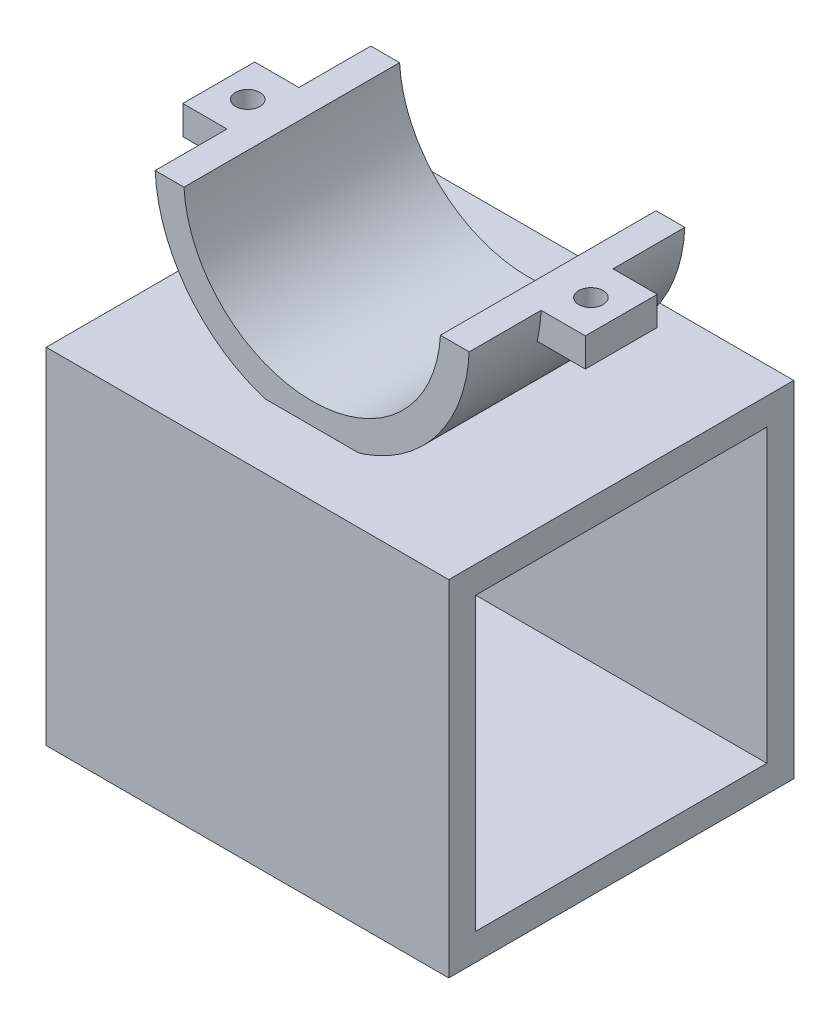
ISO-10303-21;
HEADER;
FILE_DESCRIPTION(('STEP AP214'),'2;1');
FILE_NAME('part.step','',(''),(''),'','','');
FILE_SCHEMA(('AUTOMOTIVE_DESIGN { 1 0 10303 214 1 1 1 1 }'));
ENDSEC;
DATA;
#1=APPLICATION_CONTEXT('core data for automotive mechanical design processes');
#2=APPLICATION_PROTOCOL_DEFINITION('international standard','automotive_design',2000,#1);
#3=PRODUCT_CONTEXT('',#1,'mechanical');
#4=PRODUCT('Part','Part','',(#3));
#5=PRODUCT_RELATED_PRODUCT_CATEGORY('part','',(#4));
#6=PRODUCT_DEFINITION_FORMATION('','',#4);
#7=PRODUCT_DEFINITION_CONTEXT('part definition',#1,'design');
#8=PRODUCT_DEFINITION('design','',#6,#7);
#9=PRODUCT_DEFINITION_SHAPE('','',#8);
#10=(LENGTH_UNIT() NAMED_UNIT(*) SI_UNIT(.MILLI.,.METRE.));
#11=(NAMED_UNIT(*) PLANE_ANGLE_UNIT() SI_UNIT($,.RADIAN.));
#12=(NAMED_UNIT(*) SI_UNIT($,.STERADIAN.) SOLID_ANGLE_UNIT());
#13=UNCERTAINTY_MEASURE_WITH_UNIT(LENGTH_MEASURE(1.E-05),#10,'distance_accuracy_value','');
#14=(GEOMETRIC_REPRESENTATION_CONTEXT(3) GLOBAL_UNCERTAINTY_ASSIGNED_CONTEXT((#13)) GLOBAL_UNIT_ASSIGNED_CONTEXT((#10,
#11,#12)) REPRESENTATION_CONTEXT('',''));
#15=CARTESIAN_POINT('',(0.,0.,0.));
#16=DIRECTION('',(0.,0.,1.));
#17=DIRECTION('',(1.,0.,0.));
#18=AXIS2_PLACEMENT_3D('',#15,#16,#17);
#19=CARTESIAN_POINT('',(-28.,-20.87,-24.));
#20=DIRECTION('',(0.,0.,-1.));
#21=DIRECTION('',(0.,1.,0.));
#22=AXIS2_PLACEMENT_3D('',#19,#20,#21);
#23=PLANE('',#22);
#24=DIRECTION('',(1.,0.,0.));
#25=VECTOR('',#24,1.);
#26=CARTESIAN_POINT('',(-28.,-20.87,-24.));
#27=LINE('',#26,#25);
#28=CARTESIAN_POINT('',(-28.,-20.87,-24.));
#29=VERTEX_POINT('',#28);
#30=CARTESIAN_POINT('',(28.,-20.87,-24.));
#31=VERTEX_POINT('',#30);
#32=EDGE_CURVE('E52',#29,#31,#27,.T.);
#33=ORIENTED_EDGE('',*,*,#32,.T.);
#34=DIRECTION('',(0.,1.,0.));
#35=VECTOR('',#34,1.);
#36=CARTESIAN_POINT('',(28.,-20.87,-24.));
#37=LINE('',#36,#35);
#38=CARTESIAN_POINT('',(28.,-68.87,-24.));
#39=VERTEX_POINT('',#38);
#40=EDGE_CURVE('E152',#39,#31,#37,.T.);
#41=ORIENTED_EDGE('',*,*,#40,.F.);
#42=DIRECTION('',(1.,0.,0.));
#43=VECTOR('',#42,1.);
#44=CARTESIAN_POINT('',(-28.,-68.87,-24.));
#45=LINE('',#44,#43);
#46=CARTESIAN_POINT('',(-28.,-68.87,-24.));
#47=VERTEX_POINT('',#46);
#48=EDGE_CURVE('E12',#47,#39,#45,.T.);
#49=ORIENTED_EDGE('',*,*,#48,.F.);
#50=DIRECTION('',(0.,1.,0.));
#51=VECTOR('',#50,1.);
#52=CARTESIAN_POINT('',(-28.,-20.87,-24.));
#53=LINE('',#52,#51);
#54=EDGE_CURVE('E180',#47,#29,#53,.T.);
#55=ORIENTED_EDGE('',*,*,#54,.T.);
#56=EDGE_LOOP('',(#33,#41,#49,#55));
#57=FACE_BOUND('',#56,.T.);
#58=ADVANCED_FACE('F49',(#57),#23,.T.);
#59=CARTESIAN_POINT('',(-28.,-68.87,24.));
#60=DIRECTION('',(0.,-1.,0.));
#61=DIRECTION('',(0.,0.,-1.));
#62=AXIS2_PLACEMENT_3D('',#59,#60,#61);
#63=PLANE('',#62);
#64=CARTESIAN_POINT('',(0.,-68.87,0.));
#65=DIRECTION('',(0.,-1.,0.));
#66=DIRECTION('',(0.,0.,-1.));
#67=AXIS2_PLACEMENT_3D('',#64,#65,#66);
#68=CIRCLE('',#67,4.5);
#69=CARTESIAN_POINT('',(0.,-68.87,-4.5));
#70=VERTEX_POINT('',#69);
#71=EDGE_CURVE('E138',#70,#70,#68,.T.);
#72=ORIENTED_EDGE('',*,*,#71,.F.);
#73=EDGE_LOOP('',(#72));
#74=FACE_BOUND('',#73,.T.);
#75=ORIENTED_EDGE('',*,*,#48,.T.);
#76=DIRECTION('',(0.,0.,-1.));
#77=VECTOR('',#76,1.);
#78=CARTESIAN_POINT('',(28.,-68.87,24.));
#79=LINE('',#78,#77);
#80=CARTESIAN_POINT('',(28.,-68.87,24.));
#81=VERTEX_POINT('',#80);
#82=EDGE_CURVE('E164',#81,#39,#79,.T.);
#83=ORIENTED_EDGE('',*,*,#82,.F.);
#84=DIRECTION('',(1.,0.,0.));
#85=VECTOR('',#84,1.);
#86=CARTESIAN_POINT('',(-28.,-68.87,24.));
#87=LINE('',#86,#85);
#88=CARTESIAN_POINT('',(-28.,-68.87,24.));
#89=VERTEX_POINT('',#88);
#90=EDGE_CURVE('E58',#89,#81,#87,.T.);
#91=ORIENTED_EDGE('',*,*,#90,.F.);
#92=DIRECTION('',(0.,0.,-1.));
#93=VECTOR('',#92,1.);
#94=CARTESIAN_POINT('',(-28.,-68.87,24.));
#95=LINE('',#94,#93);
#96=EDGE_CURVE('E196',#89,#47,#95,.T.);
#97=ORIENTED_EDGE('',*,*,#96,.T.);
#98=EDGE_LOOP('',(#75,#83,#91,#97));
#99=FACE_BOUND('',#98,.T.);
#100=ADVANCED_FACE('F212',(#74,#99),#63,.T.);
#101=CARTESIAN_POINT('',(-28.,-20.87,24.));
#102=DIRECTION('',(0.,0.,1.));
#103=DIRECTION('',(1.,0.,0.));
#104=AXIS2_PLACEMENT_3D('',#101,#102,#103);
#105=PLANE('',#104);
#106=ORIENTED_EDGE('',*,*,#90,.T.);
#107=DIRECTION('',(0.,-1.,0.));
#108=VECTOR('',#107,1.);
#109=CARTESIAN_POINT('',(28.,-20.87,24.));
#110=LINE('',#109,#108);
#111=CARTESIAN_POINT('',(28.,-20.87,24.));
#112=VERTEX_POINT('',#111);
#113=EDGE_CURVE('E160',#112,#81,#110,.T.);
#114=ORIENTED_EDGE('',*,*,#113,.F.);
#115=DIRECTION('',(1.,0.,0.));
#116=VECTOR('',#115,1.);
#117=CARTESIAN_POINT('',(-28.,-20.87,24.));
#118=LINE('',#117,#116);
#119=CARTESIAN_POINT('',(-28.,-20.87,24.));
#120=VERTEX_POINT('',#119);
#121=EDGE_CURVE('E201',#120,#112,#118,.T.);
#122=ORIENTED_EDGE('',*,*,#121,.F.);
#123=DIRECTION('',(0.,-1.,0.));
#124=VECTOR('',#123,1.);
#125=CARTESIAN_POINT('',(-28.,-20.87,24.));
#126=LINE('',#125,#124);
#127=EDGE_CURVE('E192',#120,#89,#126,.T.);
#128=ORIENTED_EDGE('',*,*,#127,.T.);
#129=EDGE_LOOP('',(#106,#114,#122,#128));
#130=FACE_BOUND('',#129,.T.);
#131=ADVANCED_FACE('F218',(#130),#105,.T.);
#132=CARTESIAN_POINT('',(-28.,-20.87,24.));
#133=DIRECTION('',(0.,1.,0.));
#134=DIRECTION('',(0.,0.,1.));
#135=AXIS2_PLACEMENT_3D('',#132,#133,#134);
#136=PLANE('',#135);
#137=ORIENTED_EDGE('',*,*,#121,.T.);
#138=DIRECTION('',(0.,0.,1.));
#139=VECTOR('',#138,1.);
#140=CARTESIAN_POINT('',(28.,-20.87,24.));
#141=LINE('',#140,#139);
#142=EDGE_CURVE('E156',#31,#112,#141,.T.);
#143=ORIENTED_EDGE('',*,*,#142,.F.);
#144=ORIENTED_EDGE('',*,*,#32,.F.);
#145=DIRECTION('',(0.,0.,1.));
#146=VECTOR('',#145,1.);
#147=CARTESIAN_POINT('',(-28.,-20.87,24.));
#148=LINE('',#147,#146);
#149=EDGE_CURVE('E188',#29,#120,#148,.T.);
#150=ORIENTED_EDGE('',*,*,#149,.T.);
#151=EDGE_LOOP('',(#137,#143,#144,#150));
#152=FACE_BOUND('',#151,.T.);
#153=ADVANCED_FACE('F207',(#152),#136,.T.);
#154=CARTESIAN_POINT('',(-28.,0.,0.));
#155=DIRECTION('',(1.,0.,0.));
#156=DIRECTION('',(0.,0.,-1.));
#157=AXIS2_PLACEMENT_3D('',#154,#155,#156);
#158=PLANE('',#157);
#159=DIRECTION('',(0.,0.,-1.));
#160=VECTOR('',#159,1.);
#161=CARTESIAN_POINT('',(-28.,-65.12,20.25));
#162=LINE('',#161,#160);
#163=CARTESIAN_POINT('',(-28.,-65.12,20.25));
#164=VERTEX_POINT('',#163);
#165=CARTESIAN_POINT('',(-28.,-65.12,-20.25));
#166=VERTEX_POINT('',#165);
#167=EDGE_CURVE('E128',#164,#166,#162,.T.);
#168=ORIENTED_EDGE('',*,*,#167,.T.);
#169=DIRECTION('',(0.,1.,0.));
#170=VECTOR('',#169,1.);
#171=CARTESIAN_POINT('',(-28.,-24.62,-20.25));
#172=LINE('',#171,#170);
#173=CARTESIAN_POINT('',(-28.,-24.62,-20.25));
#174=VERTEX_POINT('',#173);
#175=EDGE_CURVE('E168',#166,#174,#172,.T.);
#176=ORIENTED_EDGE('',*,*,#175,.T.);
#177=DIRECTION('',(0.,0.,1.));
#178=VECTOR('',#177,1.);
#179=CARTESIAN_POINT('',(-28.,-24.62,20.25));
#180=LINE('',#179,#178);
#181=CARTESIAN_POINT('',(-28.,-24.62,20.25));
#182=VERTEX_POINT('',#181);
#183=EDGE_CURVE('E122',#174,#182,#180,.T.);
#184=ORIENTED_EDGE('',*,*,#183,.T.);
#185=DIRECTION('',(0.,-1.,0.));
#186=VECTOR('',#185,1.);
#187=CARTESIAN_POINT('',(-28.,-24.62,20.25));
#188=LINE('',#187,#186);
#189=EDGE_CURVE('E66',#182,#164,#188,.T.);
#190=ORIENTED_EDGE('',*,*,#189,.T.);
#191=EDGE_LOOP('',(#168,#176,#184,#190));
#192=FACE_BOUND('',#191,.T.);
#193=ORIENTED_EDGE('',*,*,#54,.F.);
#194=ORIENTED_EDGE('',*,*,#96,.F.);
#195=ORIENTED_EDGE('',*,*,#127,.F.);
#196=ORIENTED_EDGE('',*,*,#149,.F.);
#197=EDGE_LOOP('',(#193,#194,#195,#196));
#198=FACE_BOUND('',#197,.T.);
#199=ADVANCED_FACE('F216',(#192,#198),#158,.F.);
#200=CARTESIAN_POINT('',(-28.,-24.62,-20.25));
#201=DIRECTION('',(0.,0.,-1.));
#202=DIRECTION('',(0.,1.,0.));
#203=AXIS2_PLACEMENT_3D('',#200,#201,#202);
#204=PLANE('',#203);
#205=DIRECTION('',(1.,0.,0.));
#206=VECTOR('',#205,1.);
#207=CARTESIAN_POINT('',(-28.,-65.12,-20.25));
#208=LINE('',#207,#206);
#209=CARTESIAN_POINT('',(28.,-65.12,-20.25));
#210=VERTEX_POINT('',#209);
#211=EDGE_CURVE('E133',#166,#210,#208,.T.);
#212=ORIENTED_EDGE('',*,*,#211,.T.);
#213=DIRECTION('',(0.,1.,0.));
#214=VECTOR('',#213,1.);
#215=CARTESIAN_POINT('',(28.,-24.62,-20.25));
#216=LINE('',#215,#214);
#217=CARTESIAN_POINT('',(28.,-24.62,-20.25));
#218=VERTEX_POINT('',#217);
#219=EDGE_CURVE('E131',#210,#218,#216,.T.);
#220=ORIENTED_EDGE('',*,*,#219,.T.);
#221=DIRECTION('',(1.,0.,0.));
#222=VECTOR('',#221,1.);
#223=CARTESIAN_POINT('',(-28.,-24.62,-20.25));
#224=LINE('',#223,#222);
#225=EDGE_CURVE('E115',#174,#218,#224,.T.);
#226=ORIENTED_EDGE('',*,*,#225,.F.);
#227=ORIENTED_EDGE('',*,*,#175,.F.);
#228=EDGE_LOOP('',(#212,#220,#226,#227));
#229=FACE_BOUND('',#228,.T.);
#230=ADVANCED_FACE('F132',(#229),#204,.F.);
#231=CARTESIAN_POINT('',(-28.,-65.12,20.25));
#232=DIRECTION('',(0.,-1.,0.));
#233=DIRECTION('',(0.,0.,-1.));
#234=AXIS2_PLACEMENT_3D('',#231,#232,#233);
#235=PLANE('',#234);
#236=CARTESIAN_POINT('',(0.,-65.12,0.));
#237=DIRECTION('',(0.,1.,0.));
#238=DIRECTION('',(0.,0.,1.));
#239=AXIS2_PLACEMENT_3D('',#236,#237,#238);
#240=CIRCLE('',#239,4.5);
#241=CARTESIAN_POINT('',(0.,-65.12,4.5));
#242=VERTEX_POINT('',#241);
#243=EDGE_CURVE('E317',#242,#242,#240,.T.);
#244=ORIENTED_EDGE('',*,*,#243,.F.);
#245=EDGE_LOOP('',(#244));
#246=FACE_BOUND('',#245,.T.);
#247=DIRECTION('',(1.,0.,0.));
#248=VECTOR('',#247,1.);
#249=CARTESIAN_POINT('',(-28.,-65.12,20.25));
#250=LINE('',#249,#248);
#251=CARTESIAN_POINT('',(28.,-65.12,20.25));
#252=VERTEX_POINT('',#251);
#253=EDGE_CURVE('E181',#164,#252,#250,.T.);
#254=ORIENTED_EDGE('',*,*,#253,.T.);
#255=DIRECTION('',(0.,0.,-1.));
#256=VECTOR('',#255,1.);
#257=CARTESIAN_POINT('',(28.,-65.12,20.25));
#258=LINE('',#257,#256);
#259=EDGE_CURVE('E146',#252,#210,#258,.T.);
#260=ORIENTED_EDGE('',*,*,#259,.T.);
#261=ORIENTED_EDGE('',*,*,#211,.F.);
#262=ORIENTED_EDGE('',*,*,#167,.F.);
#263=EDGE_LOOP('',(#254,#260,#261,#262));
#264=FACE_BOUND('',#263,.T.);
#265=ADVANCED_FACE('F245',(#246,#264),#235,.F.);
#266=CARTESIAN_POINT('',(-28.,-24.62,20.25));
#267=DIRECTION('',(0.,0.,1.));
#268=DIRECTION('',(1.,0.,0.));
#269=AXIS2_PLACEMENT_3D('',#266,#267,#268);
#270=PLANE('',#269);
#271=DIRECTION('',(1.,0.,0.));
#272=VECTOR('',#271,1.);
#273=CARTESIAN_POINT('',(-28.,-24.62,20.25));
#274=LINE('',#273,#272);
#275=CARTESIAN_POINT('',(28.,-24.62,20.25));
#276=VERTEX_POINT('',#275);
#277=EDGE_CURVE('E127',#182,#276,#274,.T.);
#278=ORIENTED_EDGE('',*,*,#277,.T.);
#279=DIRECTION('',(0.,-1.,0.));
#280=VECTOR('',#279,1.);
#281=CARTESIAN_POINT('',(28.,-24.62,20.25));
#282=LINE('',#281,#280);
#283=EDGE_CURVE('E142',#276,#252,#282,.T.);
#284=ORIENTED_EDGE('',*,*,#283,.T.);
#285=ORIENTED_EDGE('',*,*,#253,.F.);
#286=ORIENTED_EDGE('',*,*,#189,.F.);
#287=EDGE_LOOP('',(#278,#284,#285,#286));
#288=FACE_BOUND('',#287,.T.);
#289=ADVANCED_FACE('F250',(#288),#270,.F.);
#290=CARTESIAN_POINT('',(-28.,-24.62,20.25));
#291=DIRECTION('',(0.,1.,0.));
#292=DIRECTION('',(0.,0.,1.));
#293=AXIS2_PLACEMENT_3D('',#290,#291,#292);
#294=PLANE('',#293);
#295=ORIENTED_EDGE('',*,*,#225,.T.);
#296=DIRECTION('',(0.,0.,1.));
#297=VECTOR('',#296,1.);
#298=CARTESIAN_POINT('',(28.,-24.62,20.25));
#299=LINE('',#298,#297);
#300=EDGE_CURVE('E119',#218,#276,#299,.T.);
#301=ORIENTED_EDGE('',*,*,#300,.T.);
#302=ORIENTED_EDGE('',*,*,#277,.F.);
#303=ORIENTED_EDGE('',*,*,#183,.F.);
#304=EDGE_LOOP('',(#295,#301,#302,#303));
#305=FACE_BOUND('',#304,.T.);
#306=ADVANCED_FACE('F117',(#305),#294,.F.);
#307=CARTESIAN_POINT('',(28.,0.,0.));
#308=DIRECTION('',(1.,0.,0.));
#309=DIRECTION('',(0.,0.,-1.));
#310=AXIS2_PLACEMENT_3D('',#307,#308,#309);
#311=PLANE('',#310);
#312=ORIENTED_EDGE('',*,*,#40,.T.);
#313=ORIENTED_EDGE('',*,*,#142,.T.);
#314=ORIENTED_EDGE('',*,*,#113,.T.);
#315=ORIENTED_EDGE('',*,*,#82,.T.);
#316=EDGE_LOOP('',(#312,#313,#314,#315));
#317=FACE_BOUND('',#316,.T.);
#318=ORIENTED_EDGE('',*,*,#300,.F.);
#319=ORIENTED_EDGE('',*,*,#219,.F.);
#320=ORIENTED_EDGE('',*,*,#259,.F.);
#321=ORIENTED_EDGE('',*,*,#283,.F.);
#322=EDGE_LOOP('',(#318,#319,#320,#321));
#323=FACE_BOUND('',#322,.T.);
#324=ADVANCED_FACE('F140',(#317,#323),#311,.T.);
#325=CARTESIAN_POINT('',(0.,-65.12,0.));
#326=DIRECTION('',(0.,1.,0.));
#327=DIRECTION('',(0.,0.,1.));
#328=AXIS2_PLACEMENT_3D('',#325,#326,#327);
#329=CYLINDRICAL_SURFACE('',#328,4.5);
#330=ORIENTED_EDGE('',*,*,#71,.T.);
#331=EDGE_LOOP('',(#330));
#332=FACE_BOUND('',#331,.T.);
#333=ORIENTED_EDGE('',*,*,#243,.T.);
#334=EDGE_LOOP('',(#333));
#335=FACE_BOUND('',#334,.T.);
#336=ADVANCED_FACE('F260',(#332,#335),#329,.F.);
#337=CLOSED_SHELL('',(#58,#100,#131,#153,#199,#230,#265,#289,#306,#324,#336));
#338=MANIFOLD_SOLID_BREP('B2',#337);
#339=CARTESIAN_POINT('',(0.,0.,-19.6210465312143));
#340=DIRECTION('',(0.,0.,-1.));
#341=DIRECTION('',(-1.,0.,0.));
#342=AXIS2_PLACEMENT_3D('',#339,#340,#341);
#343=CYLINDRICAL_SURFACE('',#342,21.87);
#344=CARTESIAN_POINT('',(0.,0.,-15.));
#345=DIRECTION('',(0.,0.,-1.));
#346=DIRECTION('',(-1.,0.,0.));
#347=AXIS2_PLACEMENT_3D('',#344,#345,#346);
#348=CIRCLE('',#347,21.87);
#349=CARTESIAN_POINT('',(21.8471256690669,-0.999999999999997,-15.));
#350=VERTEX_POINT('',#349);
#351=CARTESIAN_POINT('',(-21.8471256690669,-0.999999999999997,-15.));
#352=VERTEX_POINT('',#351);
#353=EDGE_CURVE('E474',#350,#352,#348,.T.);
#354=ORIENTED_EDGE('',*,*,#353,.F.);
#355=DIRECTION('',(0.,0.,-1.));
#356=VECTOR('',#355,1.);
#357=CARTESIAN_POINT('',(21.8471256690669,-0.999999999999997,-19.6210465312143));
#358=LINE('',#357,#356);
#359=CARTESIAN_POINT('',(21.8471256690669,-0.999999999999997,-5.));
#360=VERTEX_POINT('',#359);
#361=EDGE_CURVE('E542',#350,#360,#358,.F.);
#362=ORIENTED_EDGE('',*,*,#361,.T.);
#363=CARTESIAN_POINT('',(0.,0.,-5.));
#364=DIRECTION('',(0.,0.,1.));
#365=DIRECTION('',(1.,0.,0.));
#366=AXIS2_PLACEMENT_3D('',#363,#364,#365);
#367=CIRCLE('',#366,21.87);
#368=CARTESIAN_POINT('',(21.2907703007665,-4.99999999999999,-5.));
#369=VERTEX_POINT('',#368);
#370=EDGE_CURVE('E449',#360,#369,#367,.F.);
#371=ORIENTED_EDGE('',*,*,#370,.T.);
#372=DIRECTION('',(0.,0.,-1.));
#373=VECTOR('',#372,1.);
#374=CARTESIAN_POINT('',(21.2907703007665,-4.99999999999999,-19.6210465312143));
#375=LINE('',#374,#373);
#376=CARTESIAN_POINT('',(21.2907703007665,-4.99999999999999,4.99999999999999));
#377=VERTEX_POINT('',#376);
#378=EDGE_CURVE('E47',#377,#369,#375,.T.);
#379=ORIENTED_EDGE('',*,*,#378,.F.);
#380=CARTESIAN_POINT('',(0.,0.,4.99999999999999));
#381=DIRECTION('',(0.,0.,1.));
#382=DIRECTION('',(1.,0.,0.));
#383=AXIS2_PLACEMENT_3D('',#380,#381,#382);
#384=CIRCLE('',#383,21.87);
#385=CARTESIAN_POINT('',(21.8471256690669,-0.999999999999997,4.99999999999999));
#386=VERTEX_POINT('',#385);
#387=EDGE_CURVE('E447',#386,#377,#384,.F.);
#388=ORIENTED_EDGE('',*,*,#387,.F.);
#389=CARTESIAN_POINT('',(21.8471256690669,-0.999999999999997,15.));
#390=VERTEX_POINT('',#389);
#391=EDGE_CURVE('E350',#386,#390,#358,.F.);
#392=ORIENTED_EDGE('',*,*,#391,.T.);
#393=CARTESIAN_POINT('',(0.,0.,15.));
#394=DIRECTION('',(0.,0.,-1.));
#395=DIRECTION('',(-1.,0.,0.));
#396=AXIS2_PLACEMENT_3D('',#393,#394,#395);
#397=CIRCLE('',#396,21.87);
#398=CARTESIAN_POINT('',(-21.8471256690669,-0.999999999999997,15.));
#399=VERTEX_POINT('',#398);
#400=EDGE_CURVE('E471',#390,#399,#397,.T.);
#401=ORIENTED_EDGE('',*,*,#400,.T.);
#402=DIRECTION('',(0.,0.,-1.));
#403=VECTOR('',#402,1.);
#404=CARTESIAN_POINT('',(-21.8471256690669,-0.999999999999997,-19.6210465312143));
#405=LINE('',#404,#403);
#406=CARTESIAN_POINT('',(-21.8471256690669,-0.999999999999997,4.99999999999999));
#407=VERTEX_POINT('',#406);
#408=EDGE_CURVE('E493',#399,#407,#405,.T.);
#409=ORIENTED_EDGE('',*,*,#408,.T.);
#410=CARTESIAN_POINT('',(0.,0.,4.99999999999999));
#411=DIRECTION('',(0.,0.,-1.));
#412=DIRECTION('',(-1.,0.,0.));
#413=AXIS2_PLACEMENT_3D('',#410,#411,#412);
#414=CIRCLE('',#413,21.87);
#415=CARTESIAN_POINT('',(-21.2907703007665,-5.,4.99999999999999));
#416=VERTEX_POINT('',#415);
#417=EDGE_CURVE('E464',#407,#416,#414,.F.);
#418=ORIENTED_EDGE('',*,*,#417,.T.);
#419=DIRECTION('',(0.,0.,-1.));
#420=VECTOR('',#419,1.);
#421=CARTESIAN_POINT('',(-21.2907703007665,-5.,-19.6210465312143));
#422=LINE('',#421,#420);
#423=CARTESIAN_POINT('',(-21.2907703007665,-5.,-5.));
#424=VERTEX_POINT('',#423);
#425=EDGE_CURVE('E335',#424,#416,#422,.F.);
#426=ORIENTED_EDGE('',*,*,#425,.F.);
#427=CARTESIAN_POINT('',(0.,0.,-5.));
#428=DIRECTION('',(0.,0.,-1.));
#429=DIRECTION('',(-1.,0.,0.));
#430=AXIS2_PLACEMENT_3D('',#427,#428,#429);
#431=CIRCLE('',#430,21.87);
#432=CARTESIAN_POINT('',(-21.8471256690669,-0.999999999999997,-5.));
#433=VERTEX_POINT('',#432);
#434=EDGE_CURVE('E466',#433,#424,#431,.F.);
#435=ORIENTED_EDGE('',*,*,#434,.F.);
#436=EDGE_CURVE('E512',#433,#352,#405,.T.);
#437=ORIENTED_EDGE('',*,*,#436,.T.);
#438=EDGE_LOOP('',(#354,#362,#371,#379,#388,#392,#401,#409,#418,#426,#435,#437));
#439=FACE_BOUND('',#438,.T.);
#440=ADVANCED_FACE('F326',(#439),#343,.T.);
#441=CARTESIAN_POINT('',(0.,0.,-19.6210465312143));
#442=DIRECTION('',(0.,0.,-1.));
#443=DIRECTION('',(-1.,0.,0.));
#444=AXIS2_PLACEMENT_3D('',#441,#442,#443);
#445=CYLINDRICAL_SURFACE('',#444,17.87);
#446=CARTESIAN_POINT('',(0.,0.,15.));
#447=DIRECTION('',(0.,0.,-1.));
#448=DIRECTION('',(-1.,0.,0.));
#449=AXIS2_PLACEMENT_3D('',#446,#447,#448);
#450=CIRCLE('',#449,17.87);
#451=CARTESIAN_POINT('',(17.841998206479,-0.999999999999997,15.));
#452=VERTEX_POINT('',#451);
#453=CARTESIAN_POINT('',(-17.841998206479,-0.999999999999997,15.));
#454=VERTEX_POINT('',#453);
#455=EDGE_CURVE('E468',#452,#454,#450,.T.);
#456=ORIENTED_EDGE('',*,*,#455,.F.);
#457=DIRECTION('',(0.,0.,-1.));
#458=VECTOR('',#457,1.);
#459=CARTESIAN_POINT('',(17.841998206479,-0.999999999999997,-19.6210465312143));
#460=LINE('',#459,#458);
#461=CARTESIAN_POINT('',(17.841998206479,-0.999999999999997,-15.));
#462=VERTEX_POINT('',#461);
#463=EDGE_CURVE('E540',#452,#462,#460,.T.);
#464=ORIENTED_EDGE('',*,*,#463,.T.);
#465=CARTESIAN_POINT('',(0.,0.,-15.));
#466=DIRECTION('',(0.,0.,-1.));
#467=DIRECTION('',(-1.,0.,0.));
#468=AXIS2_PLACEMENT_3D('',#465,#466,#467);
#469=CIRCLE('',#468,17.87);
#470=CARTESIAN_POINT('',(-17.841998206479,-0.999999999999997,-15.));
#471=VERTEX_POINT('',#470);
#472=EDGE_CURVE('E477',#462,#471,#469,.T.);
#473=ORIENTED_EDGE('',*,*,#472,.T.);
#474=DIRECTION('',(0.,0.,-1.));
#475=VECTOR('',#474,1.);
#476=CARTESIAN_POINT('',(-17.841998206479,-0.999999999999997,-19.6210465312143));
#477=LINE('',#476,#475);
#478=EDGE_CURVE('E508',#471,#454,#477,.F.);
#479=ORIENTED_EDGE('',*,*,#478,.T.);
#480=EDGE_LOOP('',(#456,#464,#473,#479));
#481=FACE_BOUND('',#480,.T.);
#482=ADVANCED_FACE('F558',(#481),#445,.F.);
#483=CARTESIAN_POINT('',(21.87,1.52717393760999E-13,-15.));
#484=DIRECTION('',(0.,0.,-1.));
#485=DIRECTION('',(-1.,0.,0.));
#486=AXIS2_PLACEMENT_3D('',#483,#484,#485);
#487=PLANE('',#486);
#488=ORIENTED_EDGE('',*,*,#353,.T.);
#489=DIRECTION('',(1.,0.,0.));
#490=VECTOR('',#489,1.);
#491=CARTESIAN_POINT('',(21.87,-0.999999999999997,-15.));
#492=LINE('',#491,#490);
#493=EDGE_CURVE('E519',#352,#471,#492,.T.);
#494=ORIENTED_EDGE('',*,*,#493,.T.);
#495=ORIENTED_EDGE('',*,*,#472,.F.);
#496=EDGE_CURVE('E546',#462,#350,#492,.T.);
#497=ORIENTED_EDGE('',*,*,#496,.T.);
#498=EDGE_LOOP('',(#488,#494,#495,#497));
#499=FACE_BOUND('',#498,.T.);
#500=ADVANCED_FACE('F328',(#499),#487,.T.);
#501=CARTESIAN_POINT('',(21.87,1.52717393760999E-13,15.));
#502=DIRECTION('',(0.,0.,1.));
#503=DIRECTION('',(1.,0.,0.));
#504=AXIS2_PLACEMENT_3D('',#501,#502,#503);
#505=PLANE('',#504);
#506=ORIENTED_EDGE('',*,*,#400,.F.);
#507=DIRECTION('',(-1.,0.,0.));
#508=VECTOR('',#507,1.);
#509=CARTESIAN_POINT('',(21.87,-0.999999999999997,15.));
#510=LINE('',#509,#508);
#511=EDGE_CURVE('E510',#390,#452,#510,.T.);
#512=ORIENTED_EDGE('',*,*,#511,.T.);
#513=ORIENTED_EDGE('',*,*,#455,.T.);
#514=EDGE_CURVE('E505',#454,#399,#510,.T.);
#515=ORIENTED_EDGE('',*,*,#514,.T.);
#516=EDGE_LOOP('',(#506,#512,#513,#515));
#517=FACE_BOUND('',#516,.T.);
#518=ADVANCED_FACE('F552',(#517),#505,.T.);
#519=CARTESIAN_POINT('',(-28.,0.,-5.));
#520=DIRECTION('',(-1.,0.,0.));
#521=DIRECTION('',(0.,0.,1.));
#522=AXIS2_PLACEMENT_3D('',#519,#520,#521);
#523=PLANE('',#522);
#524=DIRECTION('',(0.,-1.,0.));
#525=VECTOR('',#524,1.);
#526=CARTESIAN_POINT('',(-28.,0.,4.99999999999999));
#527=LINE('',#526,#525);
#528=CARTESIAN_POINT('',(-28.,-0.999999999999997,4.99999999999999));
#529=VERTEX_POINT('',#528);
#530=CARTESIAN_POINT('',(-28.,-5.,4.99999999999999));
#531=VERTEX_POINT('',#530);
#532=EDGE_CURVE('E451',#529,#531,#527,.T.);
#533=ORIENTED_EDGE('',*,*,#532,.F.);
#534=DIRECTION('',(0.,0.,-1.));
#535=VECTOR('',#534,1.);
#536=CARTESIAN_POINT('',(-28.,-0.999999999999997,-5.));
#537=LINE('',#536,#535);
#538=CARTESIAN_POINT('',(-28.,-0.999999999999997,-5.));
#539=VERTEX_POINT('',#538);
#540=EDGE_CURVE('E342',#529,#539,#537,.T.);
#541=ORIENTED_EDGE('',*,*,#540,.T.);
#542=DIRECTION('',(0.,-1.,0.));
#543=VECTOR('',#542,1.);
#544=CARTESIAN_POINT('',(-28.,0.,-5.));
#545=LINE('',#544,#543);
#546=CARTESIAN_POINT('',(-28.,-5.,-5.));
#547=VERTEX_POINT('',#546);
#548=EDGE_CURVE('E456',#539,#547,#545,.T.);
#549=ORIENTED_EDGE('',*,*,#548,.T.);
#550=DIRECTION('',(0.,0.,1.));
#551=VECTOR('',#550,1.);
#552=CARTESIAN_POINT('',(-28.,-5.,-5.));
#553=LINE('',#552,#551);
#554=EDGE_CURVE('E461',#547,#531,#553,.T.);
#555=ORIENTED_EDGE('',*,*,#554,.T.);
#556=EDGE_LOOP('',(#533,#541,#549,#555));
#557=FACE_BOUND('',#556,.T.);
#558=ADVANCED_FACE('F499',(#557),#523,.T.);
#559=CARTESIAN_POINT('',(0.,0.,-5.));
#560=DIRECTION('',(0.,0.,-1.));
#561=DIRECTION('',(-1.,0.,0.));
#562=AXIS2_PLACEMENT_3D('',#559,#560,#561);
#563=PLANE('',#562);
#564=ORIENTED_EDGE('',*,*,#548,.F.);
#565=DIRECTION('',(1.,0.,0.));
#566=VECTOR('',#565,1.);
#567=CARTESIAN_POINT('',(0.,-0.999999999999997,-5.));
#568=LINE('',#567,#566);
#569=EDGE_CURVE('E504',#539,#433,#568,.T.);
#570=ORIENTED_EDGE('',*,*,#569,.T.);
#571=ORIENTED_EDGE('',*,*,#434,.T.);
#572=DIRECTION('',(1.,0.,0.));
#573=VECTOR('',#572,1.);
#574=CARTESIAN_POINT('',(-19.87,-5.,-5.));
#575=LINE('',#574,#573);
#576=EDGE_CURVE('E458',#547,#424,#575,.T.);
#577=ORIENTED_EDGE('',*,*,#576,.F.);
#578=EDGE_LOOP('',(#564,#570,#571,#577));
#579=FACE_BOUND('',#578,.T.);
#580=ADVANCED_FACE('F502',(#579),#563,.T.);
#581=CARTESIAN_POINT('',(0.,0.,4.99999999999999));
#582=DIRECTION('',(0.,0.,-1.));
#583=DIRECTION('',(-1.,0.,0.));
#584=AXIS2_PLACEMENT_3D('',#581,#582,#583);
#585=PLANE('',#584);
#586=DIRECTION('',(1.,0.,0.));
#587=VECTOR('',#586,1.);
#588=CARTESIAN_POINT('',(0.,-0.999999999999997,4.99999999999999));
#589=LINE('',#588,#587);
#590=EDGE_CURVE('E497',#529,#407,#589,.T.);
#591=ORIENTED_EDGE('',*,*,#590,.F.);
#592=ORIENTED_EDGE('',*,*,#532,.T.);
#593=DIRECTION('',(1.,0.,0.));
#594=VECTOR('',#593,1.);
#595=CARTESIAN_POINT('',(-19.87,-5.,4.99999999999999));
#596=LINE('',#595,#594);
#597=EDGE_CURVE('E453',#531,#416,#596,.T.);
#598=ORIENTED_EDGE('',*,*,#597,.T.);
#599=ORIENTED_EDGE('',*,*,#417,.F.);
#600=EDGE_LOOP('',(#591,#592,#598,#599));
#601=FACE_BOUND('',#600,.T.);
#602=ADVANCED_FACE('F495',(#601),#585,.F.);
#603=CARTESIAN_POINT('',(28.,0.,-5.));
#604=DIRECTION('',(1.,0.,0.));
#605=DIRECTION('',(0.,0.,-1.));
#606=AXIS2_PLACEMENT_3D('',#603,#604,#605);
#607=PLANE('',#606);
#608=DIRECTION('',(0.,1.,0.));
#609=VECTOR('',#608,1.);
#610=CARTESIAN_POINT('',(28.,0.,-5.));
#611=LINE('',#610,#609);
#612=CARTESIAN_POINT('',(28.,-4.99999999999999,-5.));
#613=VERTEX_POINT('',#612);
#614=CARTESIAN_POINT('',(28.,-0.999999999999997,-5.));
#615=VERTEX_POINT('',#614);
#616=EDGE_CURVE('E431',#613,#615,#611,.T.);
#617=ORIENTED_EDGE('',*,*,#616,.T.);
#618=DIRECTION('',(0.,0.,1.));
#619=VECTOR('',#618,1.);
#620=CARTESIAN_POINT('',(28.,-0.999999999999997,-5.));
#621=LINE('',#620,#619);
#622=CARTESIAN_POINT('',(28.,-0.999999999999997,4.99999999999999));
#623=VERTEX_POINT('',#622);
#624=EDGE_CURVE('E417',#615,#623,#621,.T.);
#625=ORIENTED_EDGE('',*,*,#624,.T.);
#626=DIRECTION('',(0.,1.,0.));
#627=VECTOR('',#626,1.);
#628=CARTESIAN_POINT('',(28.,0.,4.99999999999999));
#629=LINE('',#628,#627);
#630=CARTESIAN_POINT('',(28.,-4.99999999999999,4.99999999999999));
#631=VERTEX_POINT('',#630);
#632=EDGE_CURVE('E429',#631,#623,#629,.T.);
#633=ORIENTED_EDGE('',*,*,#632,.F.);
#634=DIRECTION('',(0.,0.,1.));
#635=VECTOR('',#634,1.);
#636=CARTESIAN_POINT('',(28.,-4.99999999999999,-5.));
#637=LINE('',#636,#635);
#638=EDGE_CURVE('E445',#613,#631,#637,.T.);
#639=ORIENTED_EDGE('',*,*,#638,.F.);
#640=EDGE_LOOP('',(#617,#625,#633,#639));
#641=FACE_BOUND('',#640,.T.);
#642=ADVANCED_FACE('F427',(#641),#607,.T.);
#643=CARTESIAN_POINT('',(0.,0.,-5.));
#644=DIRECTION('',(0.,0.,1.));
#645=DIRECTION('',(1.,0.,0.));
#646=AXIS2_PLACEMENT_3D('',#643,#644,#645);
#647=PLANE('',#646);
#648=DIRECTION('',(-1.,0.,0.));
#649=VECTOR('',#648,1.);
#650=CARTESIAN_POINT('',(0.,-0.999999999999997,-5.));
#651=LINE('',#650,#649);
#652=EDGE_CURVE('E536',#615,#360,#651,.T.);
#653=ORIENTED_EDGE('',*,*,#652,.F.);
#654=ORIENTED_EDGE('',*,*,#616,.F.);
#655=DIRECTION('',(1.,0.,0.));
#656=VECTOR('',#655,1.);
#657=CARTESIAN_POINT('',(19.87,-4.99999999999999,-5.));
#658=LINE('',#657,#656);
#659=EDGE_CURVE('E437',#369,#613,#658,.T.);
#660=ORIENTED_EDGE('',*,*,#659,.F.);
#661=ORIENTED_EDGE('',*,*,#370,.F.);
#662=EDGE_LOOP('',(#653,#654,#660,#661));
#663=FACE_BOUND('',#662,.T.);
#664=ADVANCED_FACE('F534',(#663),#647,.F.);
#665=CARTESIAN_POINT('',(0.,0.,4.99999999999999));
#666=DIRECTION('',(0.,0.,1.));
#667=DIRECTION('',(1.,0.,0.));
#668=AXIS2_PLACEMENT_3D('',#665,#666,#667);
#669=PLANE('',#668);
#670=ORIENTED_EDGE('',*,*,#632,.T.);
#671=DIRECTION('',(-1.,0.,0.));
#672=VECTOR('',#671,1.);
#673=CARTESIAN_POINT('',(0.,-0.999999999999997,4.99999999999999));
#674=LINE('',#673,#672);
#675=EDGE_CURVE('E413',#623,#386,#674,.T.);
#676=ORIENTED_EDGE('',*,*,#675,.T.);
#677=ORIENTED_EDGE('',*,*,#387,.T.);
#678=DIRECTION('',(1.,0.,0.));
#679=VECTOR('',#678,1.);
#680=CARTESIAN_POINT('',(19.87,-4.99999999999999,4.99999999999999));
#681=LINE('',#680,#679);
#682=EDGE_CURVE('E435',#377,#631,#681,.T.);
#683=ORIENTED_EDGE('',*,*,#682,.T.);
#684=EDGE_LOOP('',(#670,#676,#677,#683));
#685=FACE_BOUND('',#684,.T.);
#686=ADVANCED_FACE('F433',(#685),#669,.T.);
#687=CARTESIAN_POINT('',(23.7782771535581,0.,0.));
#688=DIRECTION('',(0.,1.,0.));
#689=DIRECTION('',(0.,0.,1.));
#690=AXIS2_PLACEMENT_3D('',#687,#688,#689);
#691=CYLINDRICAL_SURFACE('',#690,1.69999999999999);
#692=CARTESIAN_POINT('',(23.7782771535581,-4.99999999999999,0.));
#693=DIRECTION('',(0.,-1.,0.));
#694=DIRECTION('',(1.,0.,0.));
#695=AXIS2_PLACEMENT_3D('',#692,#693,#694);
#696=CIRCLE('',#695,1.69999999999999);
#697=CARTESIAN_POINT('',(25.4782771535581,-4.99999999999999,0.));
#698=VERTEX_POINT('',#697);
#699=EDGE_CURVE('E440',#698,#698,#696,.T.);
#700=ORIENTED_EDGE('',*,*,#699,.T.);
#701=EDGE_LOOP('',(#700));
#702=FACE_BOUND('',#701,.T.);
#703=CARTESIAN_POINT('',(23.7782771535581,-0.999999999999997,0.));
#704=DIRECTION('',(0.,1.,0.));
#705=DIRECTION('',(0.,0.,1.));
#706=AXIS2_PLACEMENT_3D('',#703,#704,#705);
#707=CIRCLE('',#706,1.69999999999999);
#708=CARTESIAN_POINT('',(23.7782771535581,-0.999999999999997,1.69999999999999));
#709=VERTEX_POINT('',#708);
#710=EDGE_CURVE('E422',#709,#709,#707,.F.);
#711=ORIENTED_EDGE('',*,*,#710,.F.);
#712=EDGE_LOOP('',(#711));
#713=FACE_BOUND('',#712,.T.);
#714=ADVANCED_FACE('F523',(#702,#713),#691,.F.);
#715=CARTESIAN_POINT('',(-23.9700374531835,0.,0.));
#716=DIRECTION('',(0.,1.,0.));
#717=DIRECTION('',(0.,0.,1.));
#718=AXIS2_PLACEMENT_3D('',#715,#716,#717);
#719=CYLINDRICAL_SURFACE('',#718,1.69999999999999);
#720=CARTESIAN_POINT('',(-23.9700374531835,-5.,0.));
#721=DIRECTION('',(0.,-1.,0.));
#722=DIRECTION('',(1.,0.,0.));
#723=AXIS2_PLACEMENT_3D('',#720,#721,#722);
#724=CIRCLE('',#723,1.69999999999999);
#725=CARTESIAN_POINT('',(-22.2700374531835,-5.,0.));
#726=VERTEX_POINT('',#725);
#727=EDGE_CURVE('E517',#726,#726,#724,.T.);
#728=ORIENTED_EDGE('',*,*,#727,.T.);
#729=EDGE_LOOP('',(#728));
#730=FACE_BOUND('',#729,.T.);
#731=CARTESIAN_POINT('',(-23.9700374531835,-0.999999999999997,0.));
#732=DIRECTION('',(0.,1.,0.));
#733=DIRECTION('',(0.,0.,1.));
#734=AXIS2_PLACEMENT_3D('',#731,#732,#733);
#735=CIRCLE('',#734,1.69999999999999);
#736=CARTESIAN_POINT('',(-23.9700374531835,-0.999999999999997,1.69999999999999));
#737=VERTEX_POINT('',#736);
#738=EDGE_CURVE('E330',#737,#737,#735,.F.);
#739=ORIENTED_EDGE('',*,*,#738,.F.);
#740=EDGE_LOOP('',(#739));
#741=FACE_BOUND('',#740,.T.);
#742=ADVANCED_FACE('F581',(#730,#741),#719,.F.);
#743=CARTESIAN_POINT('',(-19.87,-5.,-5.));
#744=DIRECTION('',(0.,-1.,0.));
#745=DIRECTION('',(1.,0.,0.));
#746=AXIS2_PLACEMENT_3D('',#743,#744,#745);
#747=PLANE('',#746);
#748=ORIENTED_EDGE('',*,*,#727,.F.);
#749=EDGE_LOOP('',(#748));
#750=FACE_BOUND('',#749,.T.);
#751=ORIENTED_EDGE('',*,*,#576,.T.);
#752=ORIENTED_EDGE('',*,*,#425,.T.);
#753=ORIENTED_EDGE('',*,*,#597,.F.);
#754=ORIENTED_EDGE('',*,*,#554,.F.);
#755=EDGE_LOOP('',(#751,#752,#753,#754));
#756=FACE_BOUND('',#755,.T.);
#757=ADVANCED_FACE('F484',(#750,#756),#747,.T.);
#758=CARTESIAN_POINT('',(19.87,-4.99999999999999,-5.));
#759=DIRECTION('',(0.,-1.,0.));
#760=DIRECTION('',(1.,0.,0.));
#761=AXIS2_PLACEMENT_3D('',#758,#759,#760);
#762=PLANE('',#761);
#763=ORIENTED_EDGE('',*,*,#699,.F.);
#764=EDGE_LOOP('',(#763));
#765=FACE_BOUND('',#764,.T.);
#766=ORIENTED_EDGE('',*,*,#682,.F.);
#767=ORIENTED_EDGE('',*,*,#378,.T.);
#768=ORIENTED_EDGE('',*,*,#659,.T.);
#769=ORIENTED_EDGE('',*,*,#638,.T.);
#770=EDGE_LOOP('',(#766,#767,#768,#769));
#771=FACE_BOUND('',#770,.T.);
#772=ADVANCED_FACE('F526',(#765,#771),#762,.T.);
#773=CARTESIAN_POINT('',(0.,-0.999999999999997,0.));
#774=DIRECTION('',(0.,1.,0.));
#775=DIRECTION('',(0.,0.,1.));
#776=AXIS2_PLACEMENT_3D('',#773,#774,#775);
#777=PLANE('',#776);
#778=ORIENTED_EDGE('',*,*,#436,.F.);
#779=ORIENTED_EDGE('',*,*,#569,.F.);
#780=ORIENTED_EDGE('',*,*,#540,.F.);
#781=ORIENTED_EDGE('',*,*,#590,.T.);
#782=ORIENTED_EDGE('',*,*,#408,.F.);
#783=ORIENTED_EDGE('',*,*,#514,.F.);
#784=ORIENTED_EDGE('',*,*,#478,.F.);
#785=ORIENTED_EDGE('',*,*,#493,.F.);
#786=EDGE_LOOP('',(#778,#779,#780,#781,#782,#783,#784,#785));
#787=FACE_BOUND('',#786,.T.);
#788=ORIENTED_EDGE('',*,*,#738,.T.);
#789=EDGE_LOOP('',(#788));
#790=FACE_BOUND('',#789,.T.);
#791=ADVANCED_FACE('F529',(#787,#790),#777,.T.);
#792=ORIENTED_EDGE('',*,*,#463,.F.);
#793=ORIENTED_EDGE('',*,*,#511,.F.);
#794=ORIENTED_EDGE('',*,*,#391,.F.);
#795=ORIENTED_EDGE('',*,*,#675,.F.);
#796=ORIENTED_EDGE('',*,*,#624,.F.);
#797=ORIENTED_EDGE('',*,*,#652,.T.);
#798=ORIENTED_EDGE('',*,*,#361,.F.);
#799=ORIENTED_EDGE('',*,*,#496,.F.);
#800=EDGE_LOOP('',(#792,#793,#794,#795,#796,#797,#798,#799));
#801=FACE_BOUND('',#800,.T.);
#802=ORIENTED_EDGE('',*,*,#710,.T.);
#803=EDGE_LOOP('',(#802));
#804=FACE_BOUND('',#803,.T.);
#805=ADVANCED_FACE('F415',(#801,#804),#777,.T.);
#806=CLOSED_SHELL('',(#440,#482,#500,#518,#558,#580,#602,#642,#664,#686,#714,#742,#757,#772,
#791,#805));
#807=MANIFOLD_SOLID_BREP('B6',#806);
#808=ADVANCED_BREP_SHAPE_REPRESENTATION('',(#18,#338,#807),#14);
#809=SHAPE_DEFINITION_REPRESENTATION(#9,#808);
ENDSEC;
END-ISO-10303-21;
